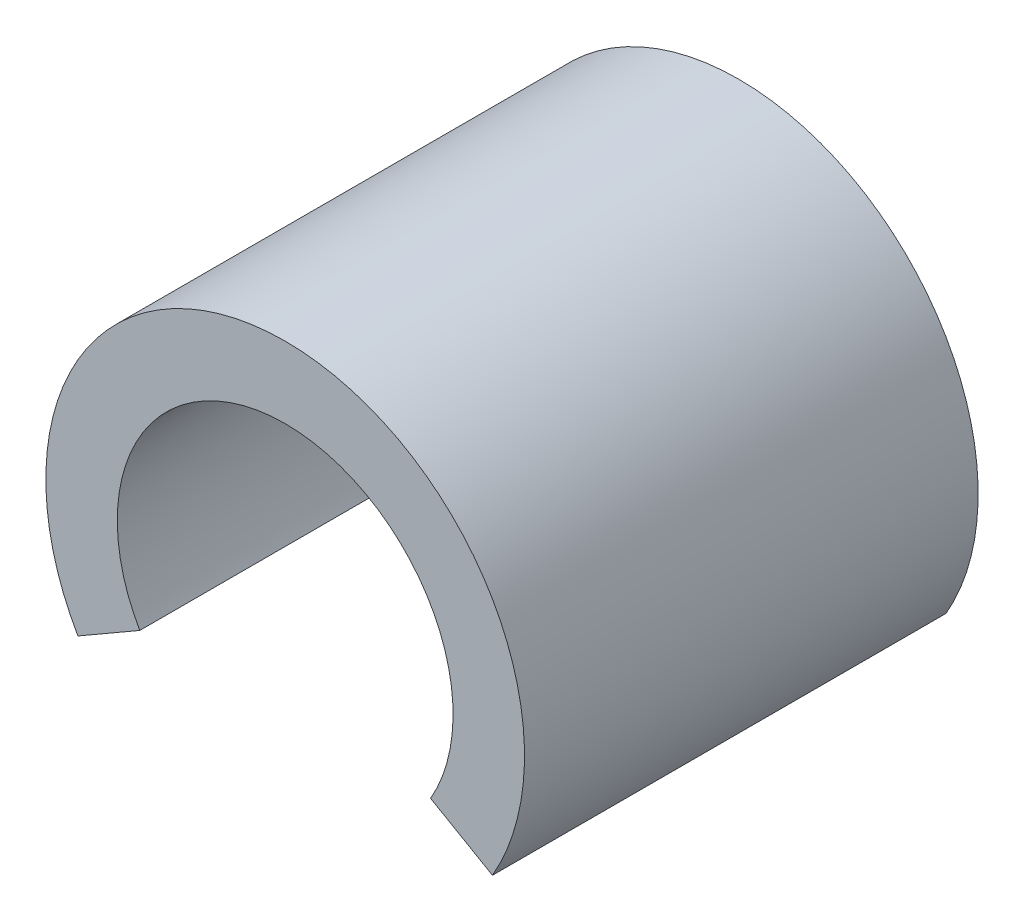
ISO-10303-21;
HEADER;
FILE_DESCRIPTION(('STEP AP214'),'2;1');
FILE_NAME('part.step','',(''),(''),'','','');
FILE_SCHEMA(('AUTOMOTIVE_DESIGN { 1 0 10303 214 1 1 1 1 }'));
ENDSEC;
DATA;
#1=APPLICATION_CONTEXT('core data for automotive mechanical design processes');
#2=APPLICATION_PROTOCOL_DEFINITION('international standard','automotive_design',2000,#1);
#3=PRODUCT_CONTEXT('',#1,'mechanical');
#4=PRODUCT('Part','Part','',(#3));
#5=PRODUCT_RELATED_PRODUCT_CATEGORY('part','',(#4));
#6=PRODUCT_DEFINITION_FORMATION('','',#4);
#7=PRODUCT_DEFINITION_CONTEXT('part definition',#1,'design');
#8=PRODUCT_DEFINITION('design','',#6,#7);
#9=PRODUCT_DEFINITION_SHAPE('','',#8);
#10=(LENGTH_UNIT() NAMED_UNIT(*) SI_UNIT(.MILLI.,.METRE.));
#11=(NAMED_UNIT(*) PLANE_ANGLE_UNIT() SI_UNIT($,.RADIAN.));
#12=(NAMED_UNIT(*) SI_UNIT($,.STERADIAN.) SOLID_ANGLE_UNIT());
#13=UNCERTAINTY_MEASURE_WITH_UNIT(LENGTH_MEASURE(1.E-05),#10,'distance_accuracy_value','');
#14=(GEOMETRIC_REPRESENTATION_CONTEXT(3) GLOBAL_UNCERTAINTY_ASSIGNED_CONTEXT((#13)) GLOBAL_UNIT_ASSIGNED_CONTEXT((#10,
#11,#12)) REPRESENTATION_CONTEXT('',''));
#15=CARTESIAN_POINT('',(0.,0.,0.));
#16=DIRECTION('',(0.,0.,1.));
#17=DIRECTION('',(1.,0.,0.));
#18=AXIS2_PLACEMENT_3D('',#15,#16,#17);
#19=CARTESIAN_POINT('',(0.,0.,12.7));
#20=DIRECTION('',(0.,0.,-1.));
#21=DIRECTION('',(-1.,0.,0.));
#22=AXIS2_PLACEMENT_3D('',#19,#20,#21);
#23=CYLINDRICAL_SURFACE('',#22,4.7);
#24=CARTESIAN_POINT('',(0.,0.,0.));
#25=DIRECTION('',(0.,0.,-1.));
#26=DIRECTION('',(1.,0.,0.));
#27=AXIS2_PLACEMENT_3D('',#24,#25,#26);
#28=CIRCLE('',#27,4.7);
#29=CARTESIAN_POINT('',(-4.07031939778687,-2.34999999999999,0.));
#30=VERTEX_POINT('',#29);
#31=CARTESIAN_POINT('',(4.07031939778688,-2.34999999999996,0.));
#32=VERTEX_POINT('',#31);
#33=EDGE_CURVE('E96',#30,#32,#28,.T.);
#34=ORIENTED_EDGE('',*,*,#33,.T.);
#35=DIRECTION('',(0.,0.,-1.));
#36=VECTOR('',#35,1.);
#37=CARTESIAN_POINT('',(4.07031939778688,-2.34999999999996,12.7));
#38=LINE('',#37,#36);
#39=CARTESIAN_POINT('',(4.07031939778688,-2.34999999999996,12.7));
#40=VERTEX_POINT('',#39);
#41=EDGE_CURVE('E11',#40,#32,#38,.T.);
#42=ORIENTED_EDGE('',*,*,#41,.F.);
#43=CARTESIAN_POINT('',(0.,0.,12.7));
#44=DIRECTION('',(0.,0.,-1.));
#45=DIRECTION('',(1.,0.,0.));
#46=AXIS2_PLACEMENT_3D('',#43,#44,#45);
#47=CIRCLE('',#46,4.7);
#48=CARTESIAN_POINT('',(-4.07031939778687,-2.34999999999999,12.7));
#49=VERTEX_POINT('',#48);
#50=EDGE_CURVE('E84',#49,#40,#47,.T.);
#51=ORIENTED_EDGE('',*,*,#50,.F.);
#52=DIRECTION('',(0.,0.,-1.));
#53=VECTOR('',#52,1.);
#54=CARTESIAN_POINT('',(-4.07031939778687,-2.34999999999999,12.7));
#55=LINE('',#54,#53);
#56=EDGE_CURVE('E92',#49,#30,#55,.T.);
#57=ORIENTED_EDGE('',*,*,#56,.T.);
#58=EDGE_LOOP('',(#34,#42,#51,#57));
#59=FACE_BOUND('',#58,.T.);
#60=ADVANCED_FACE('F33',(#59),#23,.F.);
#61=CARTESIAN_POINT('',(4.07031939778688,-2.34999999999996,12.7));
#62=DIRECTION('',(0.499999999999992,0.866025403784443,0.));
#63=DIRECTION('',(-0.866025403784443,0.499999999999992,0.));
#64=AXIS2_PLACEMENT_3D('',#61,#62,#63);
#65=PLANE('',#64);
#66=DIRECTION('',(0.866025403784443,-0.499999999999992,0.));
#67=VECTOR('',#66,1.);
#68=CARTESIAN_POINT('',(4.07031939778688,-2.34999999999996,0.));
#69=LINE('',#68,#67);
#70=CARTESIAN_POINT('',(5.80237020535577,-3.34999999999995,0.));
#71=VERTEX_POINT('',#70);
#72=EDGE_CURVE('E88',#32,#71,#69,.T.);
#73=ORIENTED_EDGE('',*,*,#72,.T.);
#74=DIRECTION('',(0.,0.,-1.));
#75=VECTOR('',#74,1.);
#76=CARTESIAN_POINT('',(5.80237020535577,-3.34999999999995,12.7));
#77=LINE('',#76,#75);
#78=CARTESIAN_POINT('',(5.80237020535577,-3.34999999999995,12.7));
#79=VERTEX_POINT('',#78);
#80=EDGE_CURVE('E41',#79,#71,#77,.T.);
#81=ORIENTED_EDGE('',*,*,#80,.F.);
#82=DIRECTION('',(0.866025403784443,-0.499999999999992,0.));
#83=VECTOR('',#82,1.);
#84=CARTESIAN_POINT('',(4.07031939778688,-2.34999999999996,12.7));
#85=LINE('',#84,#83);
#86=EDGE_CURVE('E79',#40,#79,#85,.T.);
#87=ORIENTED_EDGE('',*,*,#86,.F.);
#88=ORIENTED_EDGE('',*,*,#41,.T.);
#89=EDGE_LOOP('',(#73,#81,#87,#88));
#90=FACE_BOUND('',#89,.T.);
#91=ADVANCED_FACE('F87',(#90),#65,.F.);
#92=CARTESIAN_POINT('',(0.,0.,12.7));
#93=DIRECTION('',(0.,0.,-1.));
#94=DIRECTION('',(-1.,0.,0.));
#95=AXIS2_PLACEMENT_3D('',#92,#93,#94);
#96=CYLINDRICAL_SURFACE('',#95,6.7);
#97=CARTESIAN_POINT('',(0.,0.,0.));
#98=DIRECTION('',(0.,0.,1.));
#99=DIRECTION('',(1.,0.,0.));
#100=AXIS2_PLACEMENT_3D('',#97,#98,#99);
#101=CIRCLE('',#100,6.7);
#102=CARTESIAN_POINT('',(-5.80237020535575,-3.34999999999999,0.));
#103=VERTEX_POINT('',#102);
#104=EDGE_CURVE('E66',#71,#103,#101,.T.);
#105=ORIENTED_EDGE('',*,*,#104,.T.);
#106=DIRECTION('',(0.,0.,-1.));
#107=VECTOR('',#106,1.);
#108=CARTESIAN_POINT('',(-5.80237020535575,-3.34999999999999,12.7));
#109=LINE('',#108,#107);
#110=CARTESIAN_POINT('',(-5.80237020535575,-3.34999999999999,12.7));
#111=VERTEX_POINT('',#110);
#112=EDGE_CURVE('E89',#111,#103,#109,.T.);
#113=ORIENTED_EDGE('',*,*,#112,.F.);
#114=CARTESIAN_POINT('',(0.,0.,12.7));
#115=DIRECTION('',(0.,0.,1.));
#116=DIRECTION('',(1.,0.,0.));
#117=AXIS2_PLACEMENT_3D('',#114,#115,#116);
#118=CIRCLE('',#117,6.7);
#119=EDGE_CURVE('E82',#79,#111,#118,.T.);
#120=ORIENTED_EDGE('',*,*,#119,.F.);
#121=ORIENTED_EDGE('',*,*,#80,.T.);
#122=EDGE_LOOP('',(#105,#113,#120,#121));
#123=FACE_BOUND('',#122,.T.);
#124=ADVANCED_FACE('F90',(#123),#96,.T.);
#125=CARTESIAN_POINT('',(-4.07031939778687,-2.34999999999999,12.7));
#126=DIRECTION('',(-0.499999999999998,0.86602540378444,0.));
#127=DIRECTION('',(-0.86602540378444,-0.499999999999998,0.));
#128=AXIS2_PLACEMENT_3D('',#125,#126,#127);
#129=PLANE('',#128);
#130=DIRECTION('',(0.86602540378444,0.499999999999998,0.));
#131=VECTOR('',#130,1.);
#132=CARTESIAN_POINT('',(-4.07031939778687,-2.34999999999999,0.));
#133=LINE('',#132,#131);
#134=EDGE_CURVE('E72',#103,#30,#133,.T.);
#135=ORIENTED_EDGE('',*,*,#134,.T.);
#136=ORIENTED_EDGE('',*,*,#56,.F.);
#137=DIRECTION('',(0.86602540378444,0.499999999999998,0.));
#138=VECTOR('',#137,1.);
#139=CARTESIAN_POINT('',(-4.07031939778687,-2.34999999999999,12.7));
#140=LINE('',#139,#138);
#141=EDGE_CURVE('E49',#111,#49,#140,.T.);
#142=ORIENTED_EDGE('',*,*,#141,.F.);
#143=ORIENTED_EDGE('',*,*,#112,.T.);
#144=EDGE_LOOP('',(#135,#136,#142,#143));
#145=FACE_BOUND('',#144,.T.);
#146=ADVANCED_FACE('F103',(#145),#129,.F.);
#147=CARTESIAN_POINT('',(0.,0.,12.7));
#148=DIRECTION('',(0.,0.,1.));
#149=DIRECTION('',(1.,0.,0.));
#150=AXIS2_PLACEMENT_3D('',#147,#148,#149);
#151=PLANE('',#150);
#152=ORIENTED_EDGE('',*,*,#50,.T.);
#153=ORIENTED_EDGE('',*,*,#86,.T.);
#154=ORIENTED_EDGE('',*,*,#119,.T.);
#155=ORIENTED_EDGE('',*,*,#141,.T.);
#156=EDGE_LOOP('',(#152,#153,#154,#155));
#157=FACE_BOUND('',#156,.T.);
#158=ADVANCED_FACE('F80',(#157),#151,.T.);
#159=CARTESIAN_POINT('',(0.,0.,0.));
#160=DIRECTION('',(0.,0.,1.));
#161=DIRECTION('',(1.,0.,0.));
#162=AXIS2_PLACEMENT_3D('',#159,#160,#161);
#163=PLANE('',#162);
#164=ORIENTED_EDGE('',*,*,#33,.F.);
#165=ORIENTED_EDGE('',*,*,#134,.F.);
#166=ORIENTED_EDGE('',*,*,#104,.F.);
#167=ORIENTED_EDGE('',*,*,#72,.F.);
#168=EDGE_LOOP('',(#164,#165,#166,#167));
#169=FACE_BOUND('',#168,.T.);
#170=ADVANCED_FACE('F106',(#169),#163,.F.);
#171=CLOSED_SHELL('',(#60,#91,#124,#146,#158,#170));
#172=MANIFOLD_SOLID_BREP('B2',#171);
#173=ADVANCED_BREP_SHAPE_REPRESENTATION('',(#18,#172),#14);
#174=SHAPE_DEFINITION_REPRESENTATION(#9,#173);
ENDSEC;
END-ISO-10303-21;
